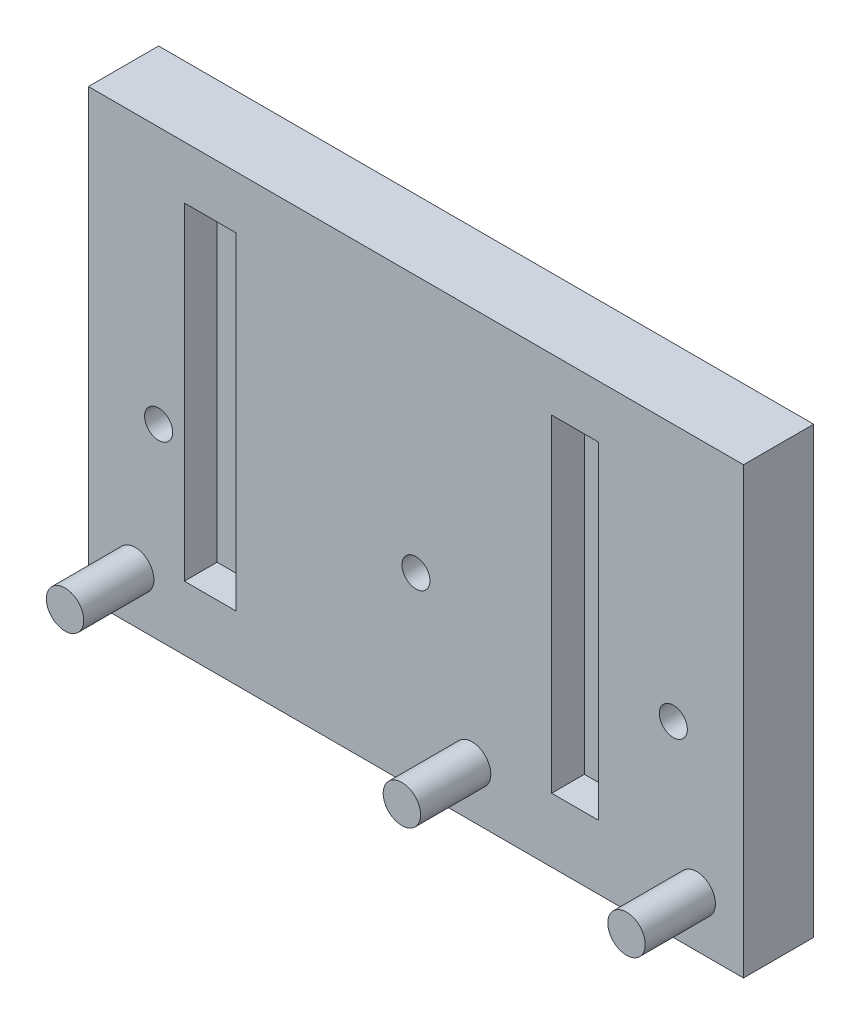
ISO-10303-21;
HEADER;
FILE_DESCRIPTION(('STEP AP214'),'2;1');
FILE_NAME('part.step','',(''),(''),'','','');
FILE_SCHEMA(('AUTOMOTIVE_DESIGN { 1 0 10303 214 1 1 1 1 }'));
ENDSEC;
DATA;
#1=APPLICATION_CONTEXT('core data for automotive mechanical design processes');
#2=APPLICATION_PROTOCOL_DEFINITION('international standard','automotive_design',2000,#1);
#3=PRODUCT_CONTEXT('',#1,'mechanical');
#4=PRODUCT('Part','Part','',(#3));
#5=PRODUCT_RELATED_PRODUCT_CATEGORY('part','',(#4));
#6=PRODUCT_DEFINITION_FORMATION('','',#4);
#7=PRODUCT_DEFINITION_CONTEXT('part definition',#1,'design');
#8=PRODUCT_DEFINITION('design','',#6,#7);
#9=PRODUCT_DEFINITION_SHAPE('','',#8);
#10=(LENGTH_UNIT() NAMED_UNIT(*) SI_UNIT(.MILLI.,.METRE.));
#11=(NAMED_UNIT(*) PLANE_ANGLE_UNIT() SI_UNIT($,.RADIAN.));
#12=(NAMED_UNIT(*) SI_UNIT($,.STERADIAN.) SOLID_ANGLE_UNIT());
#13=UNCERTAINTY_MEASURE_WITH_UNIT(LENGTH_MEASURE(1.E-05),#10,'distance_accuracy_value','');
#14=(GEOMETRIC_REPRESENTATION_CONTEXT(3) GLOBAL_UNCERTAINTY_ASSIGNED_CONTEXT((#13)) GLOBAL_UNIT_ASSIGNED_CONTEXT((#10,
#11,#12)) REPRESENTATION_CONTEXT('',''));
#15=CARTESIAN_POINT('',(0.,0.,0.));
#16=DIRECTION('',(0.,0.,1.));
#17=DIRECTION('',(1.,0.,0.));
#18=AXIS2_PLACEMENT_3D('',#15,#16,#17);
#19=CARTESIAN_POINT('',(0.,0.,0.));
#20=DIRECTION('',(0.,0.,1.));
#21=DIRECTION('',(1.,0.,0.));
#22=AXIS2_PLACEMENT_3D('',#19,#20,#21);
#23=PLANE('',#22);
#24=DIRECTION('',(1.,0.,0.));
#25=VECTOR('',#24,1.);
#26=CARTESIAN_POINT('',(0.,-913.643310138051,0.));
#27=LINE('',#26,#25);
#28=CARTESIAN_POINT('',(98.1838883110024,-913.643310138051,0.));
#29=VERTEX_POINT('',#28);
#30=CARTESIAN_POINT('',(109.183888311002,-913.643310138051,0.));
#31=VERTEX_POINT('',#30);
#32=EDGE_CURVE('E59',#29,#31,#27,.T.);
#33=ORIENTED_EDGE('',*,*,#32,.F.);
#34=DIRECTION('',(0.,1.,0.));
#35=VECTOR('',#34,1.);
#36=CARTESIAN_POINT('',(98.1838883110024,0.,0.));
#37=LINE('',#36,#35);
#38=CARTESIAN_POINT('',(98.1838883110024,-843.643310138051,0.));
#39=VERTEX_POINT('',#38);
#40=EDGE_CURVE('E167',#29,#39,#37,.T.);
#41=ORIENTED_EDGE('',*,*,#40,.T.);
#42=DIRECTION('',(1.,0.,0.));
#43=VECTOR('',#42,1.);
#44=CARTESIAN_POINT('',(0.,-843.643310138051,0.));
#45=LINE('',#44,#43);
#46=CARTESIAN_POINT('',(109.183888311002,-843.643310138051,0.));
#47=VERTEX_POINT('',#46);
#48=EDGE_CURVE('E179',#39,#47,#45,.T.);
#49=ORIENTED_EDGE('',*,*,#48,.T.);
#50=DIRECTION('',(0.,1.,0.));
#51=VECTOR('',#50,1.);
#52=CARTESIAN_POINT('',(109.183888311002,0.,0.));
#53=LINE('',#52,#51);
#54=EDGE_CURVE('E176',#31,#47,#53,.T.);
#55=ORIENTED_EDGE('',*,*,#54,.F.);
#56=EDGE_LOOP('',(#33,#41,#49,#55));
#57=FACE_BOUND('',#56,.T.);
#58=CARTESIAN_POINT('',(92.6838883110024,-887.343310138051,0.));
#59=DIRECTION('',(0.,0.,1.));
#60=DIRECTION('',(1.,0.,0.));
#61=AXIS2_PLACEMENT_3D('',#58,#59,#60);
#62=CIRCLE('',#61,3.00000000000001);
#63=CARTESIAN_POINT('',(95.6838883110024,-887.343310138051,0.));
#64=VERTEX_POINT('',#63);
#65=EDGE_CURVE('E192',#64,#64,#62,.T.);
#66=ORIENTED_EDGE('',*,*,#65,.F.);
#67=EDGE_LOOP('',(#66));
#68=FACE_BOUND('',#67,.T.);
#69=CARTESIAN_POINT('',(202.683888311002,-887.343310138051,0.));
#70=DIRECTION('',(0.,0.,1.));
#71=DIRECTION('',(1.,0.,0.));
#72=AXIS2_PLACEMENT_3D('',#69,#70,#71);
#73=CIRCLE('',#72,2.99999999999999);
#74=CARTESIAN_POINT('',(205.683888311002,-887.343310138051,0.));
#75=VERTEX_POINT('',#74);
#76=EDGE_CURVE('E198',#75,#75,#73,.T.);
#77=ORIENTED_EDGE('',*,*,#76,.F.);
#78=EDGE_LOOP('',(#77));
#79=FACE_BOUND('',#78,.T.);
#80=CARTESIAN_POINT('',(147.683888311002,-887.343310138051,0.));
#81=DIRECTION('',(0.,0.,1.));
#82=DIRECTION('',(1.,0.,0.));
#83=AXIS2_PLACEMENT_3D('',#80,#81,#82);
#84=CIRCLE('',#83,2.99999999999999);
#85=CARTESIAN_POINT('',(150.683888311002,-887.343310138051,0.));
#86=VERTEX_POINT('',#85);
#87=EDGE_CURVE('E201',#86,#86,#84,.T.);
#88=ORIENTED_EDGE('',*,*,#87,.F.);
#89=EDGE_LOOP('',(#88));
#90=FACE_BOUND('',#89,.T.);
#91=DIRECTION('',(0.,1.,0.));
#92=VECTOR('',#91,1.);
#93=CARTESIAN_POINT('',(77.6838883110024,0.,0.));
#94=LINE('',#93,#92);
#95=CARTESIAN_POINT('',(77.6838883110024,-927.343310138051,0.));
#96=VERTEX_POINT('',#95);
#97=CARTESIAN_POINT('',(77.6838883110024,-832.343310138051,0.));
#98=VERTEX_POINT('',#97);
#99=EDGE_CURVE('E218',#96,#98,#94,.T.);
#100=ORIENTED_EDGE('',*,*,#99,.F.);
#101=DIRECTION('',(1.,0.,0.));
#102=VECTOR('',#101,1.);
#103=CARTESIAN_POINT('',(0.,-927.343310138051,0.));
#104=LINE('',#103,#102);
#105=CARTESIAN_POINT('',(217.683888311002,-927.343310138051,0.));
#106=VERTEX_POINT('',#105);
#107=EDGE_CURVE('E233',#96,#106,#104,.T.);
#108=ORIENTED_EDGE('',*,*,#107,.T.);
#109=DIRECTION('',(0.,1.,0.));
#110=VECTOR('',#109,1.);
#111=CARTESIAN_POINT('',(217.683888311002,0.,0.));
#112=LINE('',#111,#110);
#113=CARTESIAN_POINT('',(217.683888311002,-832.343310138051,0.));
#114=VERTEX_POINT('',#113);
#115=EDGE_CURVE('E236',#106,#114,#112,.T.);
#116=ORIENTED_EDGE('',*,*,#115,.T.);
#117=DIRECTION('',(1.,0.,0.));
#118=VECTOR('',#117,1.);
#119=CARTESIAN_POINT('',(0.,-832.343310138051,0.));
#120=LINE('',#119,#118);
#121=EDGE_CURVE('E239',#98,#114,#120,.T.);
#122=ORIENTED_EDGE('',*,*,#121,.F.);
#123=EDGE_LOOP('',(#100,#108,#116,#122));
#124=FACE_BOUND('',#123,.T.);
#125=CARTESIAN_POINT('',(207.683888311002,-916.643310138051,0.));
#126=DIRECTION('',(0.,0.,1.));
#127=DIRECTION('',(1.,0.,0.));
#128=AXIS2_PLACEMENT_3D('',#125,#126,#127);
#129=CIRCLE('',#128,3.99999999999999);
#130=CARTESIAN_POINT('',(211.683888311002,-916.643310138051,0.));
#131=VERTEX_POINT('',#130);
#132=EDGE_CURVE('E242',#131,#131,#129,.T.);
#133=ORIENTED_EDGE('',*,*,#132,.F.);
#134=EDGE_LOOP('',(#133));
#135=FACE_BOUND('',#134,.T.);
#136=CARTESIAN_POINT('',(159.683888311002,-916.643310138051,0.));
#137=DIRECTION('',(0.,0.,1.));
#138=DIRECTION('',(1.,0.,0.));
#139=AXIS2_PLACEMENT_3D('',#136,#137,#138);
#140=CIRCLE('',#139,3.99999999999999);
#141=CARTESIAN_POINT('',(163.683888311002,-916.643310138051,0.));
#142=VERTEX_POINT('',#141);
#143=EDGE_CURVE('E245',#142,#142,#140,.T.);
#144=ORIENTED_EDGE('',*,*,#143,.F.);
#145=EDGE_LOOP('',(#144));
#146=FACE_BOUND('',#145,.T.);
#147=CARTESIAN_POINT('',(87.6838883110024,-916.643310138051,0.));
#148=DIRECTION('',(0.,0.,1.));
#149=DIRECTION('',(1.,0.,0.));
#150=AXIS2_PLACEMENT_3D('',#147,#148,#149);
#151=CIRCLE('',#150,4.00000000000001);
#152=CARTESIAN_POINT('',(91.6838883110024,-916.643310138051,0.));
#153=VERTEX_POINT('',#152);
#154=EDGE_CURVE('E223',#153,#153,#151,.T.);
#155=ORIENTED_EDGE('',*,*,#154,.F.);
#156=EDGE_LOOP('',(#155));
#157=FACE_BOUND('',#156,.T.);
#158=DIRECTION('',(-1.,0.,0.));
#159=VECTOR('',#158,1.);
#160=CARTESIAN_POINT('',(0.,-913.643310138051,0.));
#161=LINE('',#160,#159);
#162=CARTESIAN_POINT('',(186.683888311002,-913.643310138051,0.));
#163=VERTEX_POINT('',#162);
#164=CARTESIAN_POINT('',(176.683888311002,-913.643310138051,0.));
#165=VERTEX_POINT('',#164);
#166=EDGE_CURVE('E154',#163,#165,#161,.T.);
#167=ORIENTED_EDGE('',*,*,#166,.T.);
#168=DIRECTION('',(0.,1.,0.));
#169=VECTOR('',#168,1.);
#170=CARTESIAN_POINT('',(176.683888311002,0.,0.));
#171=LINE('',#170,#169);
#172=CARTESIAN_POINT('',(176.683888311002,-843.643310138051,0.));
#173=VERTEX_POINT('',#172);
#174=EDGE_CURVE('E51',#165,#173,#171,.T.);
#175=ORIENTED_EDGE('',*,*,#174,.T.);
#176=DIRECTION('',(-1.,0.,0.));
#177=VECTOR('',#176,1.);
#178=CARTESIAN_POINT('',(0.,-843.643310138051,0.));
#179=LINE('',#178,#177);
#180=CARTESIAN_POINT('',(186.683888311002,-843.643310138051,0.));
#181=VERTEX_POINT('',#180);
#182=EDGE_CURVE('E145',#181,#173,#179,.T.);
#183=ORIENTED_EDGE('',*,*,#182,.F.);
#184=DIRECTION('',(0.,1.,0.));
#185=VECTOR('',#184,1.);
#186=CARTESIAN_POINT('',(186.683888311002,0.,0.));
#187=LINE('',#186,#185);
#188=EDGE_CURVE('E148',#163,#181,#187,.T.);
#189=ORIENTED_EDGE('',*,*,#188,.F.);
#190=EDGE_LOOP('',(#167,#175,#183,#189));
#191=FACE_BOUND('',#190,.T.);
#192=ADVANCED_FACE('F34',(#57,#68,#79,#90,#124,#135,#146,#157,#191),#23,.T.);
#193=CARTESIAN_POINT('',(77.6838883110024,0.,-15.));
#194=DIRECTION('',(1.,0.,0.));
#195=DIRECTION('',(0.,0.,-1.));
#196=AXIS2_PLACEMENT_3D('',#193,#194,#195);
#197=PLANE('',#196);
#198=ORIENTED_EDGE('',*,*,#99,.T.);
#199=DIRECTION('',(0.,0.,1.));
#200=VECTOR('',#199,1.);
#201=CARTESIAN_POINT('',(77.6838883110024,-832.343310138051,-15.));
#202=LINE('',#201,#200);
#203=CARTESIAN_POINT('',(77.6838883110024,-832.343310138051,-15.));
#204=VERTEX_POINT('',#203);
#205=EDGE_CURVE('E11',#204,#98,#202,.T.);
#206=ORIENTED_EDGE('',*,*,#205,.F.);
#207=DIRECTION('',(0.,1.,0.));
#208=VECTOR('',#207,1.);
#209=CARTESIAN_POINT('',(77.6838883110024,0.,-15.));
#210=LINE('',#209,#208);
#211=CARTESIAN_POINT('',(77.6838883110024,-927.343310138051,-15.));
#212=VERTEX_POINT('',#211);
#213=EDGE_CURVE('E219',#212,#204,#210,.T.);
#214=ORIENTED_EDGE('',*,*,#213,.F.);
#215=DIRECTION('',(0.,0.,1.));
#216=VECTOR('',#215,1.);
#217=CARTESIAN_POINT('',(77.6838883110024,-927.343310138051,-15.));
#218=LINE('',#217,#216);
#219=EDGE_CURVE('E38',#212,#96,#218,.T.);
#220=ORIENTED_EDGE('',*,*,#219,.T.);
#221=EDGE_LOOP('',(#198,#206,#214,#220));
#222=FACE_BOUND('',#221,.T.);
#223=ADVANCED_FACE('F36',(#222),#197,.F.);
#224=CARTESIAN_POINT('',(0.,-832.343310138051,-15.));
#225=DIRECTION('',(0.,-1.,0.));
#226=DIRECTION('',(0.,0.,-1.));
#227=AXIS2_PLACEMENT_3D('',#224,#225,#226);
#228=PLANE('',#227);
#229=ORIENTED_EDGE('',*,*,#121,.T.);
#230=DIRECTION('',(0.,0.,1.));
#231=VECTOR('',#230,1.);
#232=CARTESIAN_POINT('',(217.683888311002,-832.343310138051,-15.));
#233=LINE('',#232,#231);
#234=CARTESIAN_POINT('',(217.683888311002,-832.343310138051,-15.));
#235=VERTEX_POINT('',#234);
#236=EDGE_CURVE('E43',#235,#114,#233,.T.);
#237=ORIENTED_EDGE('',*,*,#236,.F.);
#238=DIRECTION('',(1.,0.,0.));
#239=VECTOR('',#238,1.);
#240=CARTESIAN_POINT('',(0.,-832.343310138051,-15.));
#241=LINE('',#240,#239);
#242=EDGE_CURVE('E229',#204,#235,#241,.T.);
#243=ORIENTED_EDGE('',*,*,#242,.F.);
#244=ORIENTED_EDGE('',*,*,#205,.T.);
#245=EDGE_LOOP('',(#229,#237,#243,#244));
#246=FACE_BOUND('',#245,.T.);
#247=ADVANCED_FACE('F272',(#246),#228,.F.);
#248=CARTESIAN_POINT('',(217.683888311002,0.,-15.));
#249=DIRECTION('',(1.,0.,0.));
#250=DIRECTION('',(0.,0.,-1.));
#251=AXIS2_PLACEMENT_3D('',#248,#249,#250);
#252=PLANE('',#251);
#253=ORIENTED_EDGE('',*,*,#115,.F.);
#254=DIRECTION('',(0.,0.,1.));
#255=VECTOR('',#254,1.);
#256=CARTESIAN_POINT('',(217.683888311002,-927.343310138051,-15.));
#257=LINE('',#256,#255);
#258=CARTESIAN_POINT('',(217.683888311002,-927.343310138051,-15.));
#259=VERTEX_POINT('',#258);
#260=EDGE_CURVE('E250',#259,#106,#257,.T.);
#261=ORIENTED_EDGE('',*,*,#260,.F.);
#262=DIRECTION('',(0.,1.,0.));
#263=VECTOR('',#262,1.);
#264=CARTESIAN_POINT('',(217.683888311002,0.,-15.));
#265=LINE('',#264,#263);
#266=EDGE_CURVE('E226',#259,#235,#265,.T.);
#267=ORIENTED_EDGE('',*,*,#266,.T.);
#268=ORIENTED_EDGE('',*,*,#236,.T.);
#269=EDGE_LOOP('',(#253,#261,#267,#268));
#270=FACE_BOUND('',#269,.T.);
#271=ADVANCED_FACE('F264',(#270),#252,.T.);
#272=CARTESIAN_POINT('',(0.,-927.343310138051,-15.));
#273=DIRECTION('',(0.,-1.,0.));
#274=DIRECTION('',(0.,0.,-1.));
#275=AXIS2_PLACEMENT_3D('',#272,#273,#274);
#276=PLANE('',#275);
#277=ORIENTED_EDGE('',*,*,#107,.F.);
#278=ORIENTED_EDGE('',*,*,#219,.F.);
#279=DIRECTION('',(1.,0.,0.));
#280=VECTOR('',#279,1.);
#281=CARTESIAN_POINT('',(0.,-927.343310138051,-15.));
#282=LINE('',#281,#280);
#283=EDGE_CURVE('E222',#212,#259,#282,.T.);
#284=ORIENTED_EDGE('',*,*,#283,.T.);
#285=ORIENTED_EDGE('',*,*,#260,.T.);
#286=EDGE_LOOP('',(#277,#278,#284,#285));
#287=FACE_BOUND('',#286,.T.);
#288=ADVANCED_FACE('F261',(#287),#276,.T.);
#289=CARTESIAN_POINT('',(0.,0.,-15.));
#290=DIRECTION('',(0.,0.,1.));
#291=DIRECTION('',(1.,0.,0.));
#292=AXIS2_PLACEMENT_3D('',#289,#290,#291);
#293=PLANE('',#292);
#294=CARTESIAN_POINT('',(92.6838883110024,-887.343310138051,-15.));
#295=DIRECTION('',(0.,0.,1.));
#296=DIRECTION('',(1.,0.,0.));
#297=AXIS2_PLACEMENT_3D('',#294,#295,#296);
#298=CIRCLE('',#297,3.00000000000001);
#299=CARTESIAN_POINT('',(95.6838883110024,-887.343310138051,-15.));
#300=VERTEX_POINT('',#299);
#301=EDGE_CURVE('E186',#300,#300,#298,.T.);
#302=ORIENTED_EDGE('',*,*,#301,.T.);
#303=EDGE_LOOP('',(#302));
#304=FACE_BOUND('',#303,.T.);
#305=CARTESIAN_POINT('',(202.683888311002,-887.343310138051,-15.));
#306=DIRECTION('',(0.,0.,1.));
#307=DIRECTION('',(1.,0.,0.));
#308=AXIS2_PLACEMENT_3D('',#305,#306,#307);
#309=CIRCLE('',#308,2.99999999999999);
#310=CARTESIAN_POINT('',(205.683888311002,-887.343310138051,-15.));
#311=VERTEX_POINT('',#310);
#312=EDGE_CURVE('E195',#311,#311,#309,.T.);
#313=ORIENTED_EDGE('',*,*,#312,.T.);
#314=EDGE_LOOP('',(#313));
#315=FACE_BOUND('',#314,.T.);
#316=CARTESIAN_POINT('',(147.683888311002,-887.343310138051,-15.));
#317=DIRECTION('',(0.,0.,1.));
#318=DIRECTION('',(1.,0.,0.));
#319=AXIS2_PLACEMENT_3D('',#316,#317,#318);
#320=CIRCLE('',#319,2.99999999999999);
#321=CARTESIAN_POINT('',(150.683888311002,-887.343310138051,-15.));
#322=VERTEX_POINT('',#321);
#323=EDGE_CURVE('E204',#322,#322,#320,.T.);
#324=ORIENTED_EDGE('',*,*,#323,.T.);
#325=EDGE_LOOP('',(#324));
#326=FACE_BOUND('',#325,.T.);
#327=ORIENTED_EDGE('',*,*,#213,.T.);
#328=ORIENTED_EDGE('',*,*,#242,.T.);
#329=ORIENTED_EDGE('',*,*,#266,.F.);
#330=ORIENTED_EDGE('',*,*,#283,.F.);
#331=EDGE_LOOP('',(#327,#328,#329,#330));
#332=FACE_BOUND('',#331,.T.);
#333=ADVANCED_FACE('F263',(#304,#315,#326,#332),#293,.F.);
#334=CARTESIAN_POINT('',(87.6838883110024,-916.643310138051,15.));
#335=DIRECTION('',(0.,0.,1.));
#336=DIRECTION('',(1.,0.,0.));
#337=AXIS2_PLACEMENT_3D('',#334,#335,#336);
#338=PLANE('',#337);
#339=CARTESIAN_POINT('',(87.6838883110024,-916.643310138051,15.));
#340=DIRECTION('',(0.,0.,1.));
#341=DIRECTION('',(1.,0.,0.));
#342=AXIS2_PLACEMENT_3D('',#339,#340,#341);
#343=CIRCLE('',#342,4.00000000000001);
#344=CARTESIAN_POINT('',(91.6838883110024,-916.643310138051,15.));
#345=VERTEX_POINT('',#344);
#346=EDGE_CURVE('E215',#345,#345,#343,.T.);
#347=ORIENTED_EDGE('',*,*,#346,.T.);
#348=EDGE_LOOP('',(#347));
#349=FACE_BOUND('',#348,.T.);
#350=ADVANCED_FACE('F269',(#349),#338,.T.);
#351=CARTESIAN_POINT('',(87.6838883110024,-916.643310138051,-15.));
#352=DIRECTION('',(0.,0.,1.));
#353=DIRECTION('',(1.,0.,0.));
#354=AXIS2_PLACEMENT_3D('',#351,#352,#353);
#355=CYLINDRICAL_SURFACE('',#354,4.00000000000001);
#356=ORIENTED_EDGE('',*,*,#154,.T.);
#357=EDGE_LOOP('',(#356));
#358=FACE_BOUND('',#357,.T.);
#359=ORIENTED_EDGE('',*,*,#346,.F.);
#360=EDGE_LOOP('',(#359));
#361=FACE_BOUND('',#360,.T.);
#362=ADVANCED_FACE('F312',(#358,#361),#355,.T.);
#363=CARTESIAN_POINT('',(159.683888311002,-916.643310138051,15.));
#364=DIRECTION('',(0.,0.,1.));
#365=DIRECTION('',(1.,0.,0.));
#366=AXIS2_PLACEMENT_3D('',#363,#364,#365);
#367=PLANE('',#366);
#368=CARTESIAN_POINT('',(159.683888311002,-916.643310138051,15.));
#369=DIRECTION('',(0.,0.,1.));
#370=DIRECTION('',(1.,0.,0.));
#371=AXIS2_PLACEMENT_3D('',#368,#369,#370);
#372=CIRCLE('',#371,3.99999999999999);
#373=CARTESIAN_POINT('',(163.683888311002,-916.643310138051,15.));
#374=VERTEX_POINT('',#373);
#375=EDGE_CURVE('E212',#374,#374,#372,.T.);
#376=ORIENTED_EDGE('',*,*,#375,.T.);
#377=EDGE_LOOP('',(#376));
#378=FACE_BOUND('',#377,.T.);
#379=ADVANCED_FACE('F323',(#378),#367,.T.);
#380=CARTESIAN_POINT('',(159.683888311002,-916.643310138051,-15.));
#381=DIRECTION('',(0.,0.,1.));
#382=DIRECTION('',(1.,0.,0.));
#383=AXIS2_PLACEMENT_3D('',#380,#381,#382);
#384=CYLINDRICAL_SURFACE('',#383,3.99999999999999);
#385=ORIENTED_EDGE('',*,*,#143,.T.);
#386=EDGE_LOOP('',(#385));
#387=FACE_BOUND('',#386,.T.);
#388=ORIENTED_EDGE('',*,*,#375,.F.);
#389=EDGE_LOOP('',(#388));
#390=FACE_BOUND('',#389,.T.);
#391=ADVANCED_FACE('F332',(#387,#390),#384,.T.);
#392=CARTESIAN_POINT('',(207.683888311002,-916.643310138051,15.));
#393=DIRECTION('',(0.,0.,1.));
#394=DIRECTION('',(1.,0.,0.));
#395=AXIS2_PLACEMENT_3D('',#392,#393,#394);
#396=PLANE('',#395);
#397=CARTESIAN_POINT('',(207.683888311002,-916.643310138051,15.));
#398=DIRECTION('',(0.,0.,1.));
#399=DIRECTION('',(1.,0.,0.));
#400=AXIS2_PLACEMENT_3D('',#397,#398,#399);
#401=CIRCLE('',#400,3.99999999999999);
#402=CARTESIAN_POINT('',(211.683888311002,-916.643310138051,15.));
#403=VERTEX_POINT('',#402);
#404=EDGE_CURVE('E207',#403,#403,#401,.T.);
#405=ORIENTED_EDGE('',*,*,#404,.T.);
#406=EDGE_LOOP('',(#405));
#407=FACE_BOUND('',#406,.T.);
#408=ADVANCED_FACE('F342',(#407),#396,.T.);
#409=CARTESIAN_POINT('',(207.683888311002,-916.643310138051,-15.));
#410=DIRECTION('',(0.,0.,1.));
#411=DIRECTION('',(1.,0.,0.));
#412=AXIS2_PLACEMENT_3D('',#409,#410,#411);
#413=CYLINDRICAL_SURFACE('',#412,3.99999999999999);
#414=ORIENTED_EDGE('',*,*,#132,.T.);
#415=EDGE_LOOP('',(#414));
#416=FACE_BOUND('',#415,.T.);
#417=ORIENTED_EDGE('',*,*,#404,.F.);
#418=EDGE_LOOP('',(#417));
#419=FACE_BOUND('',#418,.T.);
#420=ADVANCED_FACE('F352',(#416,#419),#413,.T.);
#421=CARTESIAN_POINT('',(147.683888311002,-887.343310138051,-15.));
#422=DIRECTION('',(0.,0.,1.));
#423=DIRECTION('',(1.,0.,0.));
#424=AXIS2_PLACEMENT_3D('',#421,#422,#423);
#425=CYLINDRICAL_SURFACE('',#424,2.99999999999999);
#426=ORIENTED_EDGE('',*,*,#323,.F.);
#427=EDGE_LOOP('',(#426));
#428=FACE_BOUND('',#427,.T.);
#429=ORIENTED_EDGE('',*,*,#87,.T.);
#430=EDGE_LOOP('',(#429));
#431=FACE_BOUND('',#430,.T.);
#432=ADVANCED_FACE('F362',(#428,#431),#425,.F.);
#433=CARTESIAN_POINT('',(202.683888311002,-887.343310138051,-15.));
#434=DIRECTION('',(0.,0.,1.));
#435=DIRECTION('',(1.,0.,0.));
#436=AXIS2_PLACEMENT_3D('',#433,#434,#435);
#437=CYLINDRICAL_SURFACE('',#436,2.99999999999999);
#438=ORIENTED_EDGE('',*,*,#312,.F.);
#439=EDGE_LOOP('',(#438));
#440=FACE_BOUND('',#439,.T.);
#441=ORIENTED_EDGE('',*,*,#76,.T.);
#442=EDGE_LOOP('',(#441));
#443=FACE_BOUND('',#442,.T.);
#444=ADVANCED_FACE('F378',(#440,#443),#437,.F.);
#445=CARTESIAN_POINT('',(92.6838883110024,-887.343310138051,-15.));
#446=DIRECTION('',(0.,0.,1.));
#447=DIRECTION('',(1.,0.,0.));
#448=AXIS2_PLACEMENT_3D('',#445,#446,#447);
#449=CYLINDRICAL_SURFACE('',#448,3.00000000000001);
#450=ORIENTED_EDGE('',*,*,#301,.F.);
#451=EDGE_LOOP('',(#450));
#452=FACE_BOUND('',#451,.T.);
#453=ORIENTED_EDGE('',*,*,#65,.T.);
#454=EDGE_LOOP('',(#453));
#455=FACE_BOUND('',#454,.T.);
#456=ADVANCED_FACE('F388',(#452,#455),#449,.F.);
#457=CARTESIAN_POINT('',(0.,-913.643310138051,-7.));
#458=DIRECTION('',(0.,-1.,0.));
#459=DIRECTION('',(0.,0.,-1.));
#460=AXIS2_PLACEMENT_3D('',#457,#458,#459);
#461=PLANE('',#460);
#462=ORIENTED_EDGE('',*,*,#32,.T.);
#463=DIRECTION('',(0.,0.,1.));
#464=VECTOR('',#463,1.);
#465=CARTESIAN_POINT('',(109.183888311002,-913.643310138051,-7.));
#466=LINE('',#465,#464);
#467=CARTESIAN_POINT('',(109.183888311002,-913.643310138051,-7.));
#468=VERTEX_POINT('',#467);
#469=EDGE_CURVE('E174',#468,#31,#466,.T.);
#470=ORIENTED_EDGE('',*,*,#469,.F.);
#471=DIRECTION('',(1.,0.,0.));
#472=VECTOR('',#471,1.);
#473=CARTESIAN_POINT('',(0.,-913.643310138051,-7.));
#474=LINE('',#473,#472);
#475=CARTESIAN_POINT('',(98.1838883110024,-913.643310138051,-7.));
#476=VERTEX_POINT('',#475);
#477=EDGE_CURVE('E163',#476,#468,#474,.T.);
#478=ORIENTED_EDGE('',*,*,#477,.F.);
#479=DIRECTION('',(0.,0.,1.));
#480=VECTOR('',#479,1.);
#481=CARTESIAN_POINT('',(98.1838883110024,-913.643310138051,-7.));
#482=LINE('',#481,#480);
#483=EDGE_CURVE('E184',#476,#29,#482,.T.);
#484=ORIENTED_EDGE('',*,*,#483,.T.);
#485=EDGE_LOOP('',(#462,#470,#478,#484));
#486=FACE_BOUND('',#485,.T.);
#487=ADVANCED_FACE('F397',(#486),#461,.F.);
#488=CARTESIAN_POINT('',(98.1838883110024,0.,-7.));
#489=DIRECTION('',(1.,0.,0.));
#490=DIRECTION('',(0.,0.,-1.));
#491=AXIS2_PLACEMENT_3D('',#488,#489,#490);
#492=PLANE('',#491);
#493=ORIENTED_EDGE('',*,*,#40,.F.);
#494=ORIENTED_EDGE('',*,*,#483,.F.);
#495=DIRECTION('',(0.,1.,0.));
#496=VECTOR('',#495,1.);
#497=CARTESIAN_POINT('',(98.1838883110024,0.,-7.));
#498=LINE('',#497,#496);
#499=CARTESIAN_POINT('',(98.1838883110024,-843.643310138051,-7.));
#500=VERTEX_POINT('',#499);
#501=EDGE_CURVE('E172',#476,#500,#498,.T.);
#502=ORIENTED_EDGE('',*,*,#501,.T.);
#503=DIRECTION('',(0.,0.,1.));
#504=VECTOR('',#503,1.);
#505=CARTESIAN_POINT('',(98.1838883110024,-843.643310138051,-7.));
#506=LINE('',#505,#504);
#507=EDGE_CURVE('E187',#500,#39,#506,.T.);
#508=ORIENTED_EDGE('',*,*,#507,.T.);
#509=EDGE_LOOP('',(#493,#494,#502,#508));
#510=FACE_BOUND('',#509,.T.);
#511=ADVANCED_FACE('F414',(#510),#492,.T.);
#512=CARTESIAN_POINT('',(0.,-843.643310138051,-7.));
#513=DIRECTION('',(0.,-1.,0.));
#514=DIRECTION('',(0.,0.,-1.));
#515=AXIS2_PLACEMENT_3D('',#512,#513,#514);
#516=PLANE('',#515);
#517=ORIENTED_EDGE('',*,*,#48,.F.);
#518=ORIENTED_EDGE('',*,*,#507,.F.);
#519=DIRECTION('',(1.,0.,0.));
#520=VECTOR('',#519,1.);
#521=CARTESIAN_POINT('',(0.,-843.643310138051,-7.));
#522=LINE('',#521,#520);
#523=CARTESIAN_POINT('',(109.183888311002,-843.643310138051,-7.));
#524=VERTEX_POINT('',#523);
#525=EDGE_CURVE('E170',#500,#524,#522,.T.);
#526=ORIENTED_EDGE('',*,*,#525,.T.);
#527=DIRECTION('',(0.,0.,1.));
#528=VECTOR('',#527,1.);
#529=CARTESIAN_POINT('',(109.183888311002,-843.643310138051,-7.));
#530=LINE('',#529,#528);
#531=EDGE_CURVE('E189',#524,#47,#530,.T.);
#532=ORIENTED_EDGE('',*,*,#531,.T.);
#533=EDGE_LOOP('',(#517,#518,#526,#532));
#534=FACE_BOUND('',#533,.T.);
#535=ADVANCED_FACE('F423',(#534),#516,.T.);
#536=CARTESIAN_POINT('',(109.183888311002,0.,-7.));
#537=DIRECTION('',(1.,0.,0.));
#538=DIRECTION('',(0.,0.,-1.));
#539=AXIS2_PLACEMENT_3D('',#536,#537,#538);
#540=PLANE('',#539);
#541=ORIENTED_EDGE('',*,*,#54,.T.);
#542=ORIENTED_EDGE('',*,*,#531,.F.);
#543=DIRECTION('',(0.,1.,0.));
#544=VECTOR('',#543,1.);
#545=CARTESIAN_POINT('',(109.183888311002,0.,-7.));
#546=LINE('',#545,#544);
#547=EDGE_CURVE('E166',#468,#524,#546,.T.);
#548=ORIENTED_EDGE('',*,*,#547,.F.);
#549=ORIENTED_EDGE('',*,*,#469,.T.);
#550=EDGE_LOOP('',(#541,#542,#548,#549));
#551=FACE_BOUND('',#550,.T.);
#552=ADVANCED_FACE('F433',(#551),#540,.F.);
#553=CARTESIAN_POINT('',(0.,0.,-7.));
#554=DIRECTION('',(0.,0.,1.));
#555=DIRECTION('',(1.,0.,0.));
#556=AXIS2_PLACEMENT_3D('',#553,#554,#555);
#557=PLANE('',#556);
#558=ORIENTED_EDGE('',*,*,#477,.T.);
#559=ORIENTED_EDGE('',*,*,#547,.T.);
#560=ORIENTED_EDGE('',*,*,#525,.F.);
#561=ORIENTED_EDGE('',*,*,#501,.F.);
#562=EDGE_LOOP('',(#558,#559,#560,#561));
#563=FACE_BOUND('',#562,.T.);
#564=ADVANCED_FACE('F443',(#563),#557,.T.);
#565=CARTESIAN_POINT('',(176.683888311002,0.,-7.));
#566=DIRECTION('',(1.,0.,0.));
#567=DIRECTION('',(0.,0.,-1.));
#568=AXIS2_PLACEMENT_3D('',#565,#566,#567);
#569=PLANE('',#568);
#570=ORIENTED_EDGE('',*,*,#174,.F.);
#571=DIRECTION('',(0.,0.,1.));
#572=VECTOR('',#571,1.);
#573=CARTESIAN_POINT('',(176.683888311002,-913.643310138051,-7.));
#574=LINE('',#573,#572);
#575=CARTESIAN_POINT('',(176.683888311002,-913.643310138051,-7.));
#576=VERTEX_POINT('',#575);
#577=EDGE_CURVE('E128',#576,#165,#574,.T.);
#578=ORIENTED_EDGE('',*,*,#577,.F.);
#579=DIRECTION('',(0.,1.,0.));
#580=VECTOR('',#579,1.);
#581=CARTESIAN_POINT('',(176.683888311002,0.,-7.));
#582=LINE('',#581,#580);
#583=CARTESIAN_POINT('',(176.683888311002,-843.643310138051,-7.));
#584=VERTEX_POINT('',#583);
#585=EDGE_CURVE('E136',#576,#584,#582,.T.);
#586=ORIENTED_EDGE('',*,*,#585,.T.);
#587=DIRECTION('',(0.,0.,1.));
#588=VECTOR('',#587,1.);
#589=CARTESIAN_POINT('',(176.683888311002,-843.643310138051,-7.));
#590=LINE('',#589,#588);
#591=EDGE_CURVE('E158',#584,#173,#590,.T.);
#592=ORIENTED_EDGE('',*,*,#591,.T.);
#593=EDGE_LOOP('',(#570,#578,#586,#592));
#594=FACE_BOUND('',#593,.T.);
#595=ADVANCED_FACE('F138',(#594),#569,.T.);
#596=CARTESIAN_POINT('',(0.,-843.643310138051,-7.));
#597=DIRECTION('',(0.,1.,0.));
#598=DIRECTION('',(0.,0.,1.));
#599=AXIS2_PLACEMENT_3D('',#596,#597,#598);
#600=PLANE('',#599);
#601=ORIENTED_EDGE('',*,*,#182,.T.);
#602=ORIENTED_EDGE('',*,*,#591,.F.);
#603=DIRECTION('',(-1.,0.,0.));
#604=VECTOR('',#603,1.);
#605=CARTESIAN_POINT('',(0.,-843.643310138051,-7.));
#606=LINE('',#605,#604);
#607=CARTESIAN_POINT('',(186.683888311002,-843.643310138051,-7.));
#608=VERTEX_POINT('',#607);
#609=EDGE_CURVE('E140',#608,#584,#606,.T.);
#610=ORIENTED_EDGE('',*,*,#609,.F.);
#611=DIRECTION('',(0.,0.,1.));
#612=VECTOR('',#611,1.);
#613=CARTESIAN_POINT('',(186.683888311002,-843.643310138051,-7.));
#614=LINE('',#613,#612);
#615=EDGE_CURVE('E160',#608,#181,#614,.T.);
#616=ORIENTED_EDGE('',*,*,#615,.T.);
#617=EDGE_LOOP('',(#601,#602,#610,#616));
#618=FACE_BOUND('',#617,.T.);
#619=ADVANCED_FACE('F462',(#618),#600,.F.);
#620=CARTESIAN_POINT('',(186.683888311002,0.,-7.));
#621=DIRECTION('',(1.,0.,0.));
#622=DIRECTION('',(0.,0.,-1.));
#623=AXIS2_PLACEMENT_3D('',#620,#621,#622);
#624=PLANE('',#623);
#625=ORIENTED_EDGE('',*,*,#188,.T.);
#626=ORIENTED_EDGE('',*,*,#615,.F.);
#627=DIRECTION('',(0.,1.,0.));
#628=VECTOR('',#627,1.);
#629=CARTESIAN_POINT('',(186.683888311002,0.,-7.));
#630=LINE('',#629,#628);
#631=CARTESIAN_POINT('',(186.683888311002,-913.643310138051,-7.));
#632=VERTEX_POINT('',#631);
#633=EDGE_CURVE('E135',#632,#608,#630,.T.);
#634=ORIENTED_EDGE('',*,*,#633,.F.);
#635=DIRECTION('',(0.,0.,1.));
#636=VECTOR('',#635,1.);
#637=CARTESIAN_POINT('',(186.683888311002,-913.643310138051,-7.));
#638=LINE('',#637,#636);
#639=EDGE_CURVE('E130',#632,#163,#638,.T.);
#640=ORIENTED_EDGE('',*,*,#639,.T.);
#641=EDGE_LOOP('',(#625,#626,#634,#640));
#642=FACE_BOUND('',#641,.T.);
#643=ADVANCED_FACE('F471',(#642),#624,.F.);
#644=CARTESIAN_POINT('',(0.,-913.643310138051,-7.));
#645=DIRECTION('',(0.,1.,0.));
#646=DIRECTION('',(0.,0.,1.));
#647=AXIS2_PLACEMENT_3D('',#644,#645,#646);
#648=PLANE('',#647);
#649=ORIENTED_EDGE('',*,*,#166,.F.);
#650=ORIENTED_EDGE('',*,*,#639,.F.);
#651=DIRECTION('',(-1.,0.,0.));
#652=VECTOR('',#651,1.);
#653=CARTESIAN_POINT('',(0.,-913.643310138051,-7.));
#654=LINE('',#653,#652);
#655=EDGE_CURVE('E125',#632,#576,#654,.T.);
#656=ORIENTED_EDGE('',*,*,#655,.T.);
#657=ORIENTED_EDGE('',*,*,#577,.T.);
#658=EDGE_LOOP('',(#649,#650,#656,#657));
#659=FACE_BOUND('',#658,.T.);
#660=ADVANCED_FACE('F127',(#659),#648,.T.);
#661=CARTESIAN_POINT('',(0.,0.,-7.));
#662=DIRECTION('',(0.,0.,1.));
#663=DIRECTION('',(1.,0.,0.));
#664=AXIS2_PLACEMENT_3D('',#661,#662,#663);
#665=PLANE('',#664);
#666=ORIENTED_EDGE('',*,*,#585,.F.);
#667=ORIENTED_EDGE('',*,*,#655,.F.);
#668=ORIENTED_EDGE('',*,*,#633,.T.);
#669=ORIENTED_EDGE('',*,*,#609,.T.);
#670=EDGE_LOOP('',(#666,#667,#668,#669));
#671=FACE_BOUND('',#670,.T.);
#672=ADVANCED_FACE('F143',(#671),#665,.T.);
#673=CLOSED_SHELL('',(#192,#223,#247,#271,#288,#333,#350,#362,#379,#391,#408,#420,#432,#444,
#456,#487,#511,#535,#552,#564,#595,#619,#643,#660,#672));
#674=MANIFOLD_SOLID_BREP('B2',#673);
#675=ADVANCED_BREP_SHAPE_REPRESENTATION('',(#18,#674),#14);
#676=SHAPE_DEFINITION_REPRESENTATION(#9,#675);
ENDSEC;
END-ISO-10303-21;
